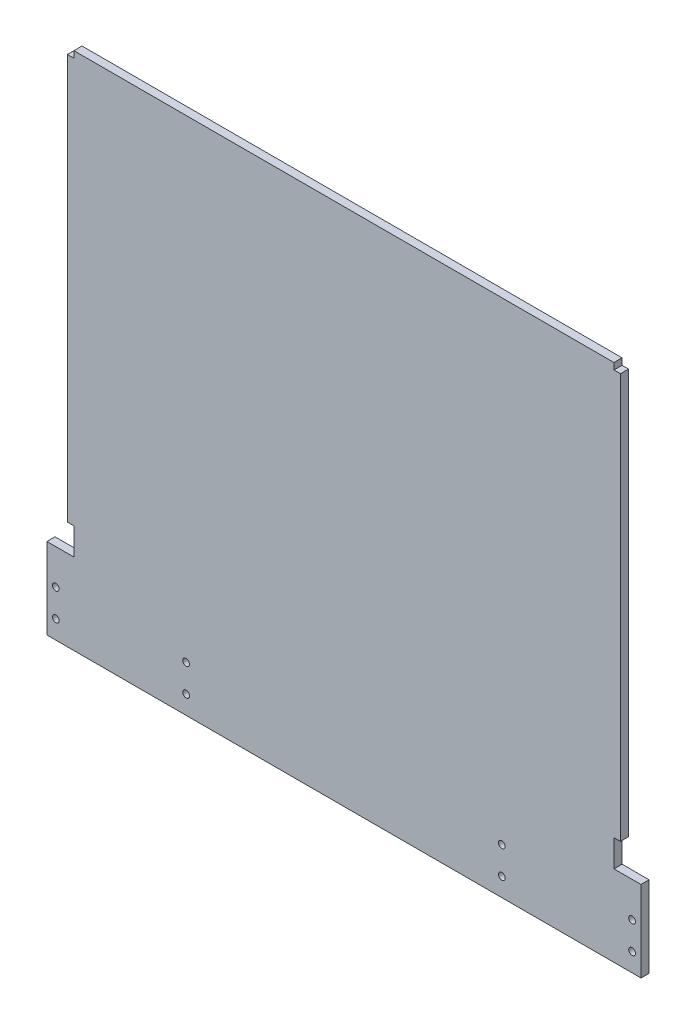
ISO-10303-21;
HEADER;
FILE_DESCRIPTION(('STEP AP214'),'2;1');
FILE_NAME('part.step','',(''),(''),'','','');
FILE_SCHEMA(('AUTOMOTIVE_DESIGN { 1 0 10303 214 1 1 1 1 }'));
ENDSEC;
DATA;
#1=APPLICATION_CONTEXT('core data for automotive mechanical design processes');
#2=APPLICATION_PROTOCOL_DEFINITION('international standard','automotive_design',2000,#1);
#3=PRODUCT_CONTEXT('',#1,'mechanical');
#4=PRODUCT('Part','Part','',(#3));
#5=PRODUCT_RELATED_PRODUCT_CATEGORY('part','',(#4));
#6=PRODUCT_DEFINITION_FORMATION('','',#4);
#7=PRODUCT_DEFINITION_CONTEXT('part definition',#1,'design');
#8=PRODUCT_DEFINITION('design','',#6,#7);
#9=PRODUCT_DEFINITION_SHAPE('','',#8);
#10=(LENGTH_UNIT() NAMED_UNIT(*) SI_UNIT(.MILLI.,.METRE.));
#11=(NAMED_UNIT(*) PLANE_ANGLE_UNIT() SI_UNIT($,.RADIAN.));
#12=(NAMED_UNIT(*) SI_UNIT($,.STERADIAN.) SOLID_ANGLE_UNIT());
#13=UNCERTAINTY_MEASURE_WITH_UNIT(LENGTH_MEASURE(1.E-05),#10,'distance_accuracy_value','');
#14=(GEOMETRIC_REPRESENTATION_CONTEXT(3) GLOBAL_UNCERTAINTY_ASSIGNED_CONTEXT((#13)) GLOBAL_UNIT_ASSIGNED_CONTEXT((#10,
#11,#12)) REPRESENTATION_CONTEXT('',''));
#15=CARTESIAN_POINT('',(0.,0.,0.));
#16=DIRECTION('',(0.,0.,1.));
#17=DIRECTION('',(1.,0.,0.));
#18=AXIS2_PLACEMENT_3D('',#15,#16,#17);
#19=CARTESIAN_POINT('',(-46.3904694643583,141.366907675195,3.));
#20=DIRECTION('',(0.,-1.,0.));
#21=DIRECTION('',(0.,0.,-1.));
#22=AXIS2_PLACEMENT_3D('',#19,#20,#21);
#23=PLANE('',#22);
#24=DIRECTION('',(-1.,0.,0.));
#25=VECTOR('',#24,1.);
#26=CARTESIAN_POINT('',(-46.3904694643583,141.366907675195,0.));
#27=LINE('',#26,#25);
#28=CARTESIAN_POINT('',(153.609530535642,141.366907675195,0.));
#29=VERTEX_POINT('',#28);
#30=CARTESIAN_POINT('',(-46.3904694643583,141.366907675195,0.));
#31=VERTEX_POINT('',#30);
#32=EDGE_CURVE('E178',#29,#31,#27,.T.);
#33=ORIENTED_EDGE('',*,*,#32,.T.);
#34=DIRECTION('',(0.,0.,-1.));
#35=VECTOR('',#34,1.);
#36=CARTESIAN_POINT('',(-46.3904694643583,141.366907675195,3.));
#37=LINE('',#36,#35);
#38=CARTESIAN_POINT('',(-46.3904694643583,141.366907675195,3.));
#39=VERTEX_POINT('',#38);
#40=EDGE_CURVE('E11',#39,#31,#37,.T.);
#41=ORIENTED_EDGE('',*,*,#40,.F.);
#42=DIRECTION('',(-1.,0.,0.));
#43=VECTOR('',#42,1.);
#44=CARTESIAN_POINT('',(-46.3904694643583,141.366907675195,3.));
#45=LINE('',#44,#43);
#46=CARTESIAN_POINT('',(153.609530535642,141.366907675195,3.));
#47=VERTEX_POINT('',#46);
#48=EDGE_CURVE('E209',#47,#39,#45,.T.);
#49=ORIENTED_EDGE('',*,*,#48,.F.);
#50=DIRECTION('',(0.,0.,-1.));
#51=VECTOR('',#50,1.);
#52=CARTESIAN_POINT('',(153.609530535642,141.366907675195,3.));
#53=LINE('',#52,#51);
#54=EDGE_CURVE('E174',#47,#29,#53,.T.);
#55=ORIENTED_EDGE('',*,*,#54,.T.);
#56=EDGE_LOOP('',(#33,#41,#49,#55));
#57=FACE_BOUND('',#56,.T.);
#58=ADVANCED_FACE('F32',(#57),#23,.F.);
#59=CARTESIAN_POINT('',(-46.3904694643583,141.366907675195,3.));
#60=DIRECTION('',(1.,0.,0.));
#61=DIRECTION('',(0.,0.,-1.));
#62=AXIS2_PLACEMENT_3D('',#59,#60,#61);
#63=PLANE('',#62);
#64=DIRECTION('',(0.,-1.,0.));
#65=VECTOR('',#64,1.);
#66=CARTESIAN_POINT('',(-46.3904694643583,141.366907675195,0.));
#67=LINE('',#66,#65);
#68=CARTESIAN_POINT('',(-46.3904694643583,138.966907675195,0.));
#69=VERTEX_POINT('',#68);
#70=EDGE_CURVE('E181',#31,#69,#67,.T.);
#71=ORIENTED_EDGE('',*,*,#70,.T.);
#72=DIRECTION('',(0.,0.,-1.));
#73=VECTOR('',#72,1.);
#74=CARTESIAN_POINT('',(-46.3904694643583,138.966907675195,3.));
#75=LINE('',#74,#73);
#76=CARTESIAN_POINT('',(-46.3904694643583,138.966907675195,3.));
#77=VERTEX_POINT('',#76);
#78=EDGE_CURVE('E41',#77,#69,#75,.T.);
#79=ORIENTED_EDGE('',*,*,#78,.F.);
#80=DIRECTION('',(0.,-1.,0.));
#81=VECTOR('',#80,1.);
#82=CARTESIAN_POINT('',(-46.3904694643583,141.366907675195,3.));
#83=LINE('',#82,#81);
#84=EDGE_CURVE('E117',#39,#77,#83,.T.);
#85=ORIENTED_EDGE('',*,*,#84,.F.);
#86=ORIENTED_EDGE('',*,*,#40,.T.);
#87=EDGE_LOOP('',(#71,#79,#85,#86));
#88=FACE_BOUND('',#87,.T.);
#89=ADVANCED_FACE('F342',(#88),#63,.F.);
#90=CARTESIAN_POINT('',(-46.3904694643583,138.966907675195,3.));
#91=DIRECTION('',(0.,-1.,0.));
#92=DIRECTION('',(0.,0.,-1.));
#93=AXIS2_PLACEMENT_3D('',#90,#91,#92);
#94=PLANE('',#93);
#95=DIRECTION('',(-1.,0.,0.));
#96=VECTOR('',#95,1.);
#97=CARTESIAN_POINT('',(-46.3904694643583,138.966907675195,0.));
#98=LINE('',#97,#96);
#99=CARTESIAN_POINT('',(-48.7904694643583,138.966907675195,0.));
#100=VERTEX_POINT('',#99);
#101=EDGE_CURVE('E184',#69,#100,#98,.T.);
#102=ORIENTED_EDGE('',*,*,#101,.T.);
#103=DIRECTION('',(0.,0.,-1.));
#104=VECTOR('',#103,1.);
#105=CARTESIAN_POINT('',(-48.7904694643583,138.966907675195,3.));
#106=LINE('',#105,#104);
#107=CARTESIAN_POINT('',(-48.7904694643583,138.966907675195,3.));
#108=VERTEX_POINT('',#107);
#109=EDGE_CURVE('E240',#108,#100,#106,.T.);
#110=ORIENTED_EDGE('',*,*,#109,.F.);
#111=DIRECTION('',(-1.,0.,0.));
#112=VECTOR('',#111,1.);
#113=CARTESIAN_POINT('',(-46.3904694643583,138.966907675195,3.));
#114=LINE('',#113,#112);
#115=EDGE_CURVE('E294',#77,#108,#114,.T.);
#116=ORIENTED_EDGE('',*,*,#115,.F.);
#117=ORIENTED_EDGE('',*,*,#78,.T.);
#118=EDGE_LOOP('',(#102,#110,#116,#117));
#119=FACE_BOUND('',#118,.T.);
#120=ADVANCED_FACE('F346',(#119),#94,.F.);
#121=CARTESIAN_POINT('',(-48.7904694643583,138.966907675195,3.));
#122=DIRECTION('',(1.,0.,0.));
#123=DIRECTION('',(0.,1.,0.));
#124=AXIS2_PLACEMENT_3D('',#121,#122,#123);
#125=PLANE('',#124);
#126=DIRECTION('',(0.,-1.,0.));
#127=VECTOR('',#126,1.);
#128=CARTESIAN_POINT('',(-48.7904694643583,138.966907675195,0.));
#129=LINE('',#128,#127);
#130=CARTESIAN_POINT('',(-48.7904694643584,-11.0330923248055,0.));
#131=VERTEX_POINT('',#130);
#132=EDGE_CURVE('E186',#100,#131,#129,.T.);
#133=ORIENTED_EDGE('',*,*,#132,.T.);
#134=DIRECTION('',(0.,0.,-1.));
#135=VECTOR('',#134,1.);
#136=CARTESIAN_POINT('',(-48.7904694643584,-11.0330923248055,3.));
#137=LINE('',#136,#135);
#138=CARTESIAN_POINT('',(-48.7904694643584,-11.0330923248055,3.));
#139=VERTEX_POINT('',#138);
#140=EDGE_CURVE('E237',#139,#131,#137,.T.);
#141=ORIENTED_EDGE('',*,*,#140,.F.);
#142=DIRECTION('',(0.,-1.,0.));
#143=VECTOR('',#142,1.);
#144=CARTESIAN_POINT('',(-48.7904694643583,138.966907675195,3.));
#145=LINE('',#144,#143);
#146=EDGE_CURVE('E296',#108,#139,#145,.T.);
#147=ORIENTED_EDGE('',*,*,#146,.F.);
#148=ORIENTED_EDGE('',*,*,#109,.T.);
#149=EDGE_LOOP('',(#133,#141,#147,#148));
#150=FACE_BOUND('',#149,.T.);
#151=ADVANCED_FACE('F350',(#150),#125,.F.);
#152=CARTESIAN_POINT('',(-48.7904694643584,-11.0330923248055,3.));
#153=DIRECTION('',(0.,1.,0.));
#154=DIRECTION('',(0.,0.,1.));
#155=AXIS2_PLACEMENT_3D('',#152,#153,#154);
#156=PLANE('',#155);
#157=DIRECTION('',(1.,0.,0.));
#158=VECTOR('',#157,1.);
#159=CARTESIAN_POINT('',(-48.7904694643584,-11.0330923248055,0.));
#160=LINE('',#159,#158);
#161=CARTESIAN_POINT('',(-46.3904694643583,-11.0330923248055,0.));
#162=VERTEX_POINT('',#161);
#163=EDGE_CURVE('E188',#131,#162,#160,.T.);
#164=ORIENTED_EDGE('',*,*,#163,.T.);
#165=DIRECTION('',(0.,0.,-1.));
#166=VECTOR('',#165,1.);
#167=CARTESIAN_POINT('',(-46.3904694643583,-11.0330923248055,3.));
#168=LINE('',#167,#166);
#169=CARTESIAN_POINT('',(-46.3904694643583,-11.0330923248055,3.));
#170=VERTEX_POINT('',#169);
#171=EDGE_CURVE('E234',#170,#162,#168,.T.);
#172=ORIENTED_EDGE('',*,*,#171,.F.);
#173=DIRECTION('',(1.,0.,0.));
#174=VECTOR('',#173,1.);
#175=CARTESIAN_POINT('',(-48.7904694643584,-11.0330923248055,3.));
#176=LINE('',#175,#174);
#177=EDGE_CURVE('E298',#139,#170,#176,.T.);
#178=ORIENTED_EDGE('',*,*,#177,.F.);
#179=ORIENTED_EDGE('',*,*,#140,.T.);
#180=EDGE_LOOP('',(#164,#172,#178,#179));
#181=FACE_BOUND('',#180,.T.);
#182=ADVANCED_FACE('F356',(#181),#156,.F.);
#183=CARTESIAN_POINT('',(-46.3904694643583,-11.0330923248055,3.));
#184=DIRECTION('',(1.,0.,0.));
#185=DIRECTION('',(0.,0.,-1.));
#186=AXIS2_PLACEMENT_3D('',#183,#184,#185);
#187=PLANE('',#186);
#188=DIRECTION('',(0.,-1.,0.));
#189=VECTOR('',#188,1.);
#190=CARTESIAN_POINT('',(-46.3904694643583,-11.0330923248055,0.));
#191=LINE('',#190,#189);
#192=CARTESIAN_POINT('',(-46.3904694643583,-21.0330923248055,0.));
#193=VERTEX_POINT('',#192);
#194=EDGE_CURVE('E190',#162,#193,#191,.T.);
#195=ORIENTED_EDGE('',*,*,#194,.T.);
#196=DIRECTION('',(0.,0.,-1.));
#197=VECTOR('',#196,1.);
#198=CARTESIAN_POINT('',(-46.3904694643583,-21.0330923248055,3.));
#199=LINE('',#198,#197);
#200=CARTESIAN_POINT('',(-46.3904694643583,-21.0330923248055,3.));
#201=VERTEX_POINT('',#200);
#202=EDGE_CURVE('E231',#201,#193,#199,.T.);
#203=ORIENTED_EDGE('',*,*,#202,.F.);
#204=DIRECTION('',(0.,-1.,0.));
#205=VECTOR('',#204,1.);
#206=CARTESIAN_POINT('',(-46.3904694643583,-11.0330923248055,3.));
#207=LINE('',#206,#205);
#208=EDGE_CURVE('E300',#170,#201,#207,.T.);
#209=ORIENTED_EDGE('',*,*,#208,.F.);
#210=ORIENTED_EDGE('',*,*,#171,.T.);
#211=EDGE_LOOP('',(#195,#203,#209,#210));
#212=FACE_BOUND('',#211,.T.);
#213=ADVANCED_FACE('F360',(#212),#187,.F.);
#214=CARTESIAN_POINT('',(-46.3904694643583,-21.0330923248055,3.));
#215=DIRECTION('',(0.,-1.,0.));
#216=DIRECTION('',(0.,0.,-1.));
#217=AXIS2_PLACEMENT_3D('',#214,#215,#216);
#218=PLANE('',#217);
#219=DIRECTION('',(-1.,0.,0.));
#220=VECTOR('',#219,1.);
#221=CARTESIAN_POINT('',(-46.3904694643583,-21.0330923248055,0.));
#222=LINE('',#221,#220);
#223=CARTESIAN_POINT('',(-56.3904694643583,-21.0330923248055,0.));
#224=VERTEX_POINT('',#223);
#225=EDGE_CURVE('E192',#193,#224,#222,.T.);
#226=ORIENTED_EDGE('',*,*,#225,.T.);
#227=DIRECTION('',(0.,0.,-1.));
#228=VECTOR('',#227,1.);
#229=CARTESIAN_POINT('',(-56.3904694643583,-21.0330923248055,3.));
#230=LINE('',#229,#228);
#231=CARTESIAN_POINT('',(-56.3904694643583,-21.0330923248055,3.));
#232=VERTEX_POINT('',#231);
#233=EDGE_CURVE('E228',#232,#224,#230,.T.);
#234=ORIENTED_EDGE('',*,*,#233,.F.);
#235=DIRECTION('',(-1.,0.,0.));
#236=VECTOR('',#235,1.);
#237=CARTESIAN_POINT('',(-46.3904694643583,-21.0330923248055,3.));
#238=LINE('',#237,#236);
#239=EDGE_CURVE('E302',#201,#232,#238,.T.);
#240=ORIENTED_EDGE('',*,*,#239,.F.);
#241=ORIENTED_EDGE('',*,*,#202,.T.);
#242=EDGE_LOOP('',(#226,#234,#240,#241));
#243=FACE_BOUND('',#242,.T.);
#244=ADVANCED_FACE('F364',(#243),#218,.F.);
#245=CARTESIAN_POINT('',(-56.3904694643583,-21.0330923248055,3.));
#246=DIRECTION('',(1.,0.,0.));
#247=DIRECTION('',(0.,0.,-1.));
#248=AXIS2_PLACEMENT_3D('',#245,#246,#247);
#249=PLANE('',#248);
#250=DIRECTION('',(0.,-1.,0.));
#251=VECTOR('',#250,1.);
#252=CARTESIAN_POINT('',(-56.3904694643583,-21.0330923248055,0.));
#253=LINE('',#252,#251);
#254=CARTESIAN_POINT('',(-56.3904694643583,-51.0330923248055,0.));
#255=VERTEX_POINT('',#254);
#256=EDGE_CURVE('E194',#224,#255,#253,.T.);
#257=ORIENTED_EDGE('',*,*,#256,.T.);
#258=DIRECTION('',(0.,0.,-1.));
#259=VECTOR('',#258,1.);
#260=CARTESIAN_POINT('',(-56.3904694643583,-51.0330923248055,3.));
#261=LINE('',#260,#259);
#262=CARTESIAN_POINT('',(-56.3904694643583,-51.0330923248055,3.));
#263=VERTEX_POINT('',#262);
#264=EDGE_CURVE('E225',#263,#255,#261,.T.);
#265=ORIENTED_EDGE('',*,*,#264,.F.);
#266=DIRECTION('',(0.,-1.,0.));
#267=VECTOR('',#266,1.);
#268=CARTESIAN_POINT('',(-56.3904694643583,-21.0330923248055,3.));
#269=LINE('',#268,#267);
#270=EDGE_CURVE('E304',#232,#263,#269,.T.);
#271=ORIENTED_EDGE('',*,*,#270,.F.);
#272=ORIENTED_EDGE('',*,*,#233,.T.);
#273=EDGE_LOOP('',(#257,#265,#271,#272));
#274=FACE_BOUND('',#273,.T.);
#275=ADVANCED_FACE('F368',(#274),#249,.F.);
#276=CARTESIAN_POINT('',(163.609530535642,-51.0330923248055,3.));
#277=DIRECTION('',(0.,1.,0.));
#278=DIRECTION('',(0.,0.,1.));
#279=AXIS2_PLACEMENT_3D('',#276,#277,#278);
#280=PLANE('',#279);
#281=DIRECTION('',(1.,0.,0.));
#282=VECTOR('',#281,1.);
#283=CARTESIAN_POINT('',(163.609530535642,-51.0330923248055,0.));
#284=LINE('',#283,#282);
#285=CARTESIAN_POINT('',(163.609530535642,-51.0330923248055,0.));
#286=VERTEX_POINT('',#285);
#287=EDGE_CURVE('E196',#255,#286,#284,.T.);
#288=ORIENTED_EDGE('',*,*,#287,.T.);
#289=DIRECTION('',(0.,0.,-1.));
#290=VECTOR('',#289,1.);
#291=CARTESIAN_POINT('',(163.609530535642,-51.0330923248055,3.));
#292=LINE('',#291,#290);
#293=CARTESIAN_POINT('',(163.609530535642,-51.0330923248055,3.));
#294=VERTEX_POINT('',#293);
#295=EDGE_CURVE('E222',#294,#286,#292,.T.);
#296=ORIENTED_EDGE('',*,*,#295,.F.);
#297=DIRECTION('',(1.,0.,0.));
#298=VECTOR('',#297,1.);
#299=CARTESIAN_POINT('',(163.609530535642,-51.0330923248055,3.));
#300=LINE('',#299,#298);
#301=EDGE_CURVE('E306',#263,#294,#300,.T.);
#302=ORIENTED_EDGE('',*,*,#301,.F.);
#303=ORIENTED_EDGE('',*,*,#264,.T.);
#304=EDGE_LOOP('',(#288,#296,#302,#303));
#305=FACE_BOUND('',#304,.T.);
#306=ADVANCED_FACE('F372',(#305),#280,.F.);
#307=CARTESIAN_POINT('',(163.609530535642,-21.0330923248055,3.));
#308=DIRECTION('',(-1.,0.,0.));
#309=DIRECTION('',(0.,0.,1.));
#310=AXIS2_PLACEMENT_3D('',#307,#308,#309);
#311=PLANE('',#310);
#312=DIRECTION('',(0.,1.,0.));
#313=VECTOR('',#312,1.);
#314=CARTESIAN_POINT('',(163.609530535642,-21.0330923248055,0.));
#315=LINE('',#314,#313);
#316=CARTESIAN_POINT('',(163.609530535642,-21.0330923248055,0.));
#317=VERTEX_POINT('',#316);
#318=EDGE_CURVE('E198',#286,#317,#315,.T.);
#319=ORIENTED_EDGE('',*,*,#318,.T.);
#320=DIRECTION('',(0.,0.,-1.));
#321=VECTOR('',#320,1.);
#322=CARTESIAN_POINT('',(163.609530535642,-21.0330923248055,3.));
#323=LINE('',#322,#321);
#324=CARTESIAN_POINT('',(163.609530535642,-21.0330923248055,3.));
#325=VERTEX_POINT('',#324);
#326=EDGE_CURVE('E219',#325,#317,#323,.T.);
#327=ORIENTED_EDGE('',*,*,#326,.F.);
#328=DIRECTION('',(0.,1.,0.));
#329=VECTOR('',#328,1.);
#330=CARTESIAN_POINT('',(163.609530535642,-21.0330923248055,3.));
#331=LINE('',#330,#329);
#332=EDGE_CURVE('E308',#294,#325,#331,.T.);
#333=ORIENTED_EDGE('',*,*,#332,.F.);
#334=ORIENTED_EDGE('',*,*,#295,.T.);
#335=EDGE_LOOP('',(#319,#327,#333,#334));
#336=FACE_BOUND('',#335,.T.);
#337=ADVANCED_FACE('F376',(#336),#311,.F.);
#338=CARTESIAN_POINT('',(153.609530535642,-21.0330923248055,3.));
#339=DIRECTION('',(0.,-1.,0.));
#340=DIRECTION('',(0.,0.,-1.));
#341=AXIS2_PLACEMENT_3D('',#338,#339,#340);
#342=PLANE('',#341);
#343=DIRECTION('',(-1.,0.,0.));
#344=VECTOR('',#343,1.);
#345=CARTESIAN_POINT('',(153.609530535642,-21.0330923248055,0.));
#346=LINE('',#345,#344);
#347=CARTESIAN_POINT('',(153.609530535642,-21.0330923248055,0.));
#348=VERTEX_POINT('',#347);
#349=EDGE_CURVE('E200',#317,#348,#346,.T.);
#350=ORIENTED_EDGE('',*,*,#349,.T.);
#351=DIRECTION('',(0.,0.,-1.));
#352=VECTOR('',#351,1.);
#353=CARTESIAN_POINT('',(153.609530535642,-21.0330923248055,3.));
#354=LINE('',#353,#352);
#355=CARTESIAN_POINT('',(153.609530535642,-21.0330923248055,3.));
#356=VERTEX_POINT('',#355);
#357=EDGE_CURVE('E216',#356,#348,#354,.T.);
#358=ORIENTED_EDGE('',*,*,#357,.F.);
#359=DIRECTION('',(-1.,0.,0.));
#360=VECTOR('',#359,1.);
#361=CARTESIAN_POINT('',(153.609530535642,-21.0330923248055,3.));
#362=LINE('',#361,#360);
#363=EDGE_CURVE('E310',#325,#356,#362,.T.);
#364=ORIENTED_EDGE('',*,*,#363,.F.);
#365=ORIENTED_EDGE('',*,*,#326,.T.);
#366=EDGE_LOOP('',(#350,#358,#364,#365));
#367=FACE_BOUND('',#366,.T.);
#368=ADVANCED_FACE('F380',(#367),#342,.F.);
#369=CARTESIAN_POINT('',(153.609530535642,-11.0330923248055,3.));
#370=DIRECTION('',(-1.,0.,0.));
#371=DIRECTION('',(0.,0.,1.));
#372=AXIS2_PLACEMENT_3D('',#369,#370,#371);
#373=PLANE('',#372);
#374=DIRECTION('',(0.,1.,0.));
#375=VECTOR('',#374,1.);
#376=CARTESIAN_POINT('',(153.609530535642,-11.0330923248055,0.));
#377=LINE('',#376,#375);
#378=CARTESIAN_POINT('',(153.609530535642,-11.0330923248055,0.));
#379=VERTEX_POINT('',#378);
#380=EDGE_CURVE('E202',#348,#379,#377,.T.);
#381=ORIENTED_EDGE('',*,*,#380,.T.);
#382=DIRECTION('',(0.,0.,-1.));
#383=VECTOR('',#382,1.);
#384=CARTESIAN_POINT('',(153.609530535642,-11.0330923248055,3.));
#385=LINE('',#384,#383);
#386=CARTESIAN_POINT('',(153.609530535642,-11.0330923248055,3.));
#387=VERTEX_POINT('',#386);
#388=EDGE_CURVE('E213',#387,#379,#385,.T.);
#389=ORIENTED_EDGE('',*,*,#388,.F.);
#390=DIRECTION('',(0.,1.,0.));
#391=VECTOR('',#390,1.);
#392=CARTESIAN_POINT('',(153.609530535642,-11.0330923248055,3.));
#393=LINE('',#392,#391);
#394=EDGE_CURVE('E312',#356,#387,#393,.T.);
#395=ORIENTED_EDGE('',*,*,#394,.F.);
#396=ORIENTED_EDGE('',*,*,#357,.T.);
#397=EDGE_LOOP('',(#381,#389,#395,#396));
#398=FACE_BOUND('',#397,.T.);
#399=ADVANCED_FACE('F318',(#398),#373,.F.);
#400=CARTESIAN_POINT('',(156.009530535642,-11.0330923248055,3.));
#401=DIRECTION('',(0.,1.,0.));
#402=DIRECTION('',(0.,0.,1.));
#403=AXIS2_PLACEMENT_3D('',#400,#401,#402);
#404=PLANE('',#403);
#405=DIRECTION('',(1.,0.,0.));
#406=VECTOR('',#405,1.);
#407=CARTESIAN_POINT('',(156.009530535642,-11.0330923248055,0.));
#408=LINE('',#407,#406);
#409=CARTESIAN_POINT('',(156.009530535642,-11.0330923248055,0.));
#410=VERTEX_POINT('',#409);
#411=EDGE_CURVE('E204',#379,#410,#408,.T.);
#412=ORIENTED_EDGE('',*,*,#411,.T.);
#413=DIRECTION('',(0.,0.,-1.));
#414=VECTOR('',#413,1.);
#415=CARTESIAN_POINT('',(156.009530535642,-11.0330923248055,3.));
#416=LINE('',#415,#414);
#417=CARTESIAN_POINT('',(156.009530535642,-11.0330923248055,3.));
#418=VERTEX_POINT('',#417);
#419=EDGE_CURVE('E169',#418,#410,#416,.T.);
#420=ORIENTED_EDGE('',*,*,#419,.F.);
#421=DIRECTION('',(1.,0.,0.));
#422=VECTOR('',#421,1.);
#423=CARTESIAN_POINT('',(156.009530535642,-11.0330923248055,3.));
#424=LINE('',#423,#422);
#425=EDGE_CURVE('E160',#387,#418,#424,.T.);
#426=ORIENTED_EDGE('',*,*,#425,.F.);
#427=ORIENTED_EDGE('',*,*,#388,.T.);
#428=EDGE_LOOP('',(#412,#420,#426,#427));
#429=FACE_BOUND('',#428,.T.);
#430=ADVANCED_FACE('F322',(#429),#404,.F.);
#431=CARTESIAN_POINT('',(156.009530535642,138.966907675195,3.));
#432=DIRECTION('',(-1.,0.,0.));
#433=DIRECTION('',(0.,-1.,0.));
#434=AXIS2_PLACEMENT_3D('',#431,#432,#433);
#435=PLANE('',#434);
#436=DIRECTION('',(0.,1.,0.));
#437=VECTOR('',#436,1.);
#438=CARTESIAN_POINT('',(156.009530535642,138.966907675195,0.));
#439=LINE('',#438,#437);
#440=CARTESIAN_POINT('',(156.009530535642,138.966907675195,0.));
#441=VERTEX_POINT('',#440);
#442=EDGE_CURVE('E168',#410,#441,#439,.T.);
#443=ORIENTED_EDGE('',*,*,#442,.T.);
#444=DIRECTION('',(0.,0.,-1.));
#445=VECTOR('',#444,1.);
#446=CARTESIAN_POINT('',(156.009530535642,138.966907675195,3.));
#447=LINE('',#446,#445);
#448=CARTESIAN_POINT('',(156.009530535642,138.966907675195,3.));
#449=VERTEX_POINT('',#448);
#450=EDGE_CURVE('E165',#449,#441,#447,.T.);
#451=ORIENTED_EDGE('',*,*,#450,.F.);
#452=DIRECTION('',(0.,1.,0.));
#453=VECTOR('',#452,1.);
#454=CARTESIAN_POINT('',(156.009530535642,138.966907675195,3.));
#455=LINE('',#454,#453);
#456=EDGE_CURVE('E154',#418,#449,#455,.T.);
#457=ORIENTED_EDGE('',*,*,#456,.F.);
#458=ORIENTED_EDGE('',*,*,#419,.T.);
#459=EDGE_LOOP('',(#443,#451,#457,#458));
#460=FACE_BOUND('',#459,.T.);
#461=ADVANCED_FACE('F166',(#460),#435,.F.);
#462=CARTESIAN_POINT('',(153.609530535642,138.966907675195,3.));
#463=DIRECTION('',(0.,-1.,0.));
#464=DIRECTION('',(0.,0.,-1.));
#465=AXIS2_PLACEMENT_3D('',#462,#463,#464);
#466=PLANE('',#465);
#467=DIRECTION('',(-1.,0.,0.));
#468=VECTOR('',#467,1.);
#469=CARTESIAN_POINT('',(153.609530535642,138.966907675195,0.));
#470=LINE('',#469,#468);
#471=CARTESIAN_POINT('',(153.609530535642,138.966907675195,0.));
#472=VERTEX_POINT('',#471);
#473=EDGE_CURVE('E103',#441,#472,#470,.T.);
#474=ORIENTED_EDGE('',*,*,#473,.T.);
#475=DIRECTION('',(0.,0.,-1.));
#476=VECTOR('',#475,1.);
#477=CARTESIAN_POINT('',(153.609530535642,138.966907675195,3.));
#478=LINE('',#477,#476);
#479=CARTESIAN_POINT('',(153.609530535642,138.966907675195,3.));
#480=VERTEX_POINT('',#479);
#481=EDGE_CURVE('E170',#480,#472,#478,.T.);
#482=ORIENTED_EDGE('',*,*,#481,.F.);
#483=DIRECTION('',(-1.,0.,0.));
#484=VECTOR('',#483,1.);
#485=CARTESIAN_POINT('',(153.609530535642,138.966907675195,3.));
#486=LINE('',#485,#484);
#487=EDGE_CURVE('E158',#449,#480,#486,.T.);
#488=ORIENTED_EDGE('',*,*,#487,.F.);
#489=ORIENTED_EDGE('',*,*,#450,.T.);
#490=EDGE_LOOP('',(#474,#482,#488,#489));
#491=FACE_BOUND('',#490,.T.);
#492=ADVANCED_FACE('F172',(#491),#466,.F.);
#493=CARTESIAN_POINT('',(153.609530535642,141.366907675195,3.));
#494=DIRECTION('',(-1.,0.,0.));
#495=DIRECTION('',(0.,0.,1.));
#496=AXIS2_PLACEMENT_3D('',#493,#494,#495);
#497=PLANE('',#496);
#498=DIRECTION('',(0.,1.,0.));
#499=VECTOR('',#498,1.);
#500=CARTESIAN_POINT('',(153.609530535642,141.366907675195,0.));
#501=LINE('',#500,#499);
#502=EDGE_CURVE('E109',#472,#29,#501,.T.);
#503=ORIENTED_EDGE('',*,*,#502,.T.);
#504=ORIENTED_EDGE('',*,*,#54,.F.);
#505=DIRECTION('',(0.,1.,0.));
#506=VECTOR('',#505,1.);
#507=CARTESIAN_POINT('',(153.609530535642,141.366907675195,3.));
#508=LINE('',#507,#506);
#509=EDGE_CURVE('E50',#480,#47,#508,.T.);
#510=ORIENTED_EDGE('',*,*,#509,.F.);
#511=ORIENTED_EDGE('',*,*,#481,.T.);
#512=EDGE_LOOP('',(#503,#504,#510,#511));
#513=FACE_BOUND('',#512,.T.);
#514=ADVANCED_FACE('F330',(#513),#497,.F.);
#515=CARTESIAN_POINT('',(153.609530535642,141.366907675195,3.));
#516=DIRECTION('',(0.,0.,-1.));
#517=DIRECTION('',(-1.,0.,0.));
#518=AXIS2_PLACEMENT_3D('',#515,#516,#517);
#519=PLANE('',#518);
#520=CARTESIAN_POINT('',(-53.1004694643583,-34.0330923248054,3.));
#521=DIRECTION('',(0.,0.,1.));
#522=DIRECTION('',(-1.,0.,0.));
#523=AXIS2_PLACEMENT_3D('',#520,#521,#522);
#524=CIRCLE('',#523,1.25000000000001);
#525=CARTESIAN_POINT('',(-54.3504694643583,-34.0330923248054,3.));
#526=VERTEX_POINT('',#525);
#527=EDGE_CURVE('E279',#526,#526,#524,.T.);
#528=ORIENTED_EDGE('',*,*,#527,.F.);
#529=EDGE_LOOP('',(#528));
#530=FACE_BOUND('',#529,.T.);
#531=CARTESIAN_POINT('',(-4.84046946435834,-34.0330923248053,3.));
#532=DIRECTION('',(0.,0.,1.));
#533=DIRECTION('',(-1.,0.,0.));
#534=AXIS2_PLACEMENT_3D('',#531,#532,#533);
#535=CIRCLE('',#534,1.24999999999991);
#536=CARTESIAN_POINT('',(-6.09046946435825,-34.0330923248053,3.));
#537=VERTEX_POINT('',#536);
#538=EDGE_CURVE('E269',#537,#537,#535,.T.);
#539=ORIENTED_EDGE('',*,*,#538,.F.);
#540=EDGE_LOOP('',(#539));
#541=FACE_BOUND('',#540,.T.);
#542=CARTESIAN_POINT('',(-53.1004694643583,-44.1930923248054,3.));
#543=DIRECTION('',(0.,0.,1.));
#544=DIRECTION('',(-1.,0.,0.));
#545=AXIS2_PLACEMENT_3D('',#542,#543,#544);
#546=CIRCLE('',#545,1.25000000000012);
#547=CARTESIAN_POINT('',(-54.3504694643585,-44.1930923248054,3.));
#548=VERTEX_POINT('',#547);
#549=EDGE_CURVE('E266',#548,#548,#546,.T.);
#550=ORIENTED_EDGE('',*,*,#549,.F.);
#551=EDGE_LOOP('',(#550));
#552=FACE_BOUND('',#551,.T.);
#553=CARTESIAN_POINT('',(-4.84046946435845,-44.1930923248057,3.));
#554=DIRECTION('',(0.,0.,1.));
#555=DIRECTION('',(-1.,0.,0.));
#556=AXIS2_PLACEMENT_3D('',#553,#554,#555);
#557=CIRCLE('',#556,1.25000000000001);
#558=CARTESIAN_POINT('',(-6.09046946435847,-44.1930923248057,3.));
#559=VERTEX_POINT('',#558);
#560=EDGE_CURVE('E263',#559,#559,#557,.T.);
#561=ORIENTED_EDGE('',*,*,#560,.F.);
#562=EDGE_LOOP('',(#561));
#563=FACE_BOUND('',#562,.T.);
#564=CARTESIAN_POINT('',(112.059530535642,-44.1930923248058,3.));
#565=DIRECTION('',(0.,0.,1.));
#566=DIRECTION('',(1.,0.,0.));
#567=AXIS2_PLACEMENT_3D('',#564,#565,#566);
#568=CIRCLE('',#567,1.25000000000001);
#569=CARTESIAN_POINT('',(113.309530535642,-44.1930923248058,3.));
#570=VERTEX_POINT('',#569);
#571=EDGE_CURVE('E259',#570,#570,#568,.T.);
#572=ORIENTED_EDGE('',*,*,#571,.F.);
#573=EDGE_LOOP('',(#572));
#574=FACE_BOUND('',#573,.T.);
#575=CARTESIAN_POINT('',(160.319530535642,-44.1930923248055,3.));
#576=DIRECTION('',(0.,0.,1.));
#577=DIRECTION('',(1.,0.,0.));
#578=AXIS2_PLACEMENT_3D('',#575,#576,#577);
#579=CIRCLE('',#578,1.25000000000012);
#580=CARTESIAN_POINT('',(161.569530535642,-44.1930923248055,3.));
#581=VERTEX_POINT('',#580);
#582=EDGE_CURVE('E255',#581,#581,#579,.T.);
#583=ORIENTED_EDGE('',*,*,#582,.F.);
#584=EDGE_LOOP('',(#583));
#585=FACE_BOUND('',#584,.T.);
#586=CARTESIAN_POINT('',(112.059530535642,-34.0330923248055,3.));
#587=DIRECTION('',(0.,0.,1.));
#588=DIRECTION('',(1.,0.,0.));
#589=AXIS2_PLACEMENT_3D('',#586,#587,#588);
#590=CIRCLE('',#589,1.24999999999991);
#591=CARTESIAN_POINT('',(113.309530535642,-34.0330923248055,3.));
#592=VERTEX_POINT('',#591);
#593=EDGE_CURVE('E251',#592,#592,#590,.T.);
#594=ORIENTED_EDGE('',*,*,#593,.F.);
#595=EDGE_LOOP('',(#594));
#596=FACE_BOUND('',#595,.T.);
#597=CARTESIAN_POINT('',(160.319530535642,-34.0330923248055,3.));
#598=DIRECTION('',(0.,0.,1.));
#599=DIRECTION('',(1.,0.,0.));
#600=AXIS2_PLACEMENT_3D('',#597,#598,#599);
#601=CIRCLE('',#600,1.25000000000001);
#602=CARTESIAN_POINT('',(161.569530535642,-34.0330923248055,3.));
#603=VERTEX_POINT('',#602);
#604=EDGE_CURVE('E247',#603,#603,#601,.T.);
#605=ORIENTED_EDGE('',*,*,#604,.F.);
#606=EDGE_LOOP('',(#605));
#607=FACE_BOUND('',#606,.T.);
#608=ORIENTED_EDGE('',*,*,#48,.T.);
#609=ORIENTED_EDGE('',*,*,#84,.T.);
#610=ORIENTED_EDGE('',*,*,#115,.T.);
#611=ORIENTED_EDGE('',*,*,#146,.T.);
#612=ORIENTED_EDGE('',*,*,#177,.T.);
#613=ORIENTED_EDGE('',*,*,#208,.T.);
#614=ORIENTED_EDGE('',*,*,#239,.T.);
#615=ORIENTED_EDGE('',*,*,#270,.T.);
#616=ORIENTED_EDGE('',*,*,#301,.T.);
#617=ORIENTED_EDGE('',*,*,#332,.T.);
#618=ORIENTED_EDGE('',*,*,#363,.T.);
#619=ORIENTED_EDGE('',*,*,#394,.T.);
#620=ORIENTED_EDGE('',*,*,#425,.T.);
#621=ORIENTED_EDGE('',*,*,#456,.T.);
#622=ORIENTED_EDGE('',*,*,#487,.T.);
#623=ORIENTED_EDGE('',*,*,#509,.T.);
#624=EDGE_LOOP('',(#608,#609,#610,#611,#612,#613,#614,#615,#616,#617,#618,#619,#620,#621,#622,#623));
#625=FACE_BOUND('',#624,.T.);
#626=ADVANCED_FACE('F156',(#530,#541,#552,#563,#574,#585,#596,#607,#625),#519,.F.);
#627=CARTESIAN_POINT('',(153.609530535642,141.366907675195,0.));
#628=DIRECTION('',(0.,0.,-1.));
#629=DIRECTION('',(-1.,0.,0.));
#630=AXIS2_PLACEMENT_3D('',#627,#628,#629);
#631=PLANE('',#630);
#632=CARTESIAN_POINT('',(-53.1004694643583,-34.0330923248054,0.));
#633=DIRECTION('',(0.,0.,-1.));
#634=DIRECTION('',(-1.,0.,0.));
#635=AXIS2_PLACEMENT_3D('',#632,#633,#634);
#636=CIRCLE('',#635,1.25000000000001);
#637=CARTESIAN_POINT('',(-54.3504694643583,-34.0330923248054,0.));
#638=VERTEX_POINT('',#637);
#639=EDGE_CURVE('E35',#638,#638,#636,.T.);
#640=ORIENTED_EDGE('',*,*,#639,.F.);
#641=EDGE_LOOP('',(#640));
#642=FACE_BOUND('',#641,.T.);
#643=CARTESIAN_POINT('',(-4.84046946435834,-34.0330923248053,0.));
#644=DIRECTION('',(0.,0.,-1.));
#645=DIRECTION('',(-1.,0.,0.));
#646=AXIS2_PLACEMENT_3D('',#643,#644,#645);
#647=CIRCLE('',#646,1.24999999999991);
#648=CARTESIAN_POINT('',(-6.09046946435825,-34.0330923248053,0.));
#649=VERTEX_POINT('',#648);
#650=EDGE_CURVE('E267',#649,#649,#647,.T.);
#651=ORIENTED_EDGE('',*,*,#650,.F.);
#652=EDGE_LOOP('',(#651));
#653=FACE_BOUND('',#652,.T.);
#654=CARTESIAN_POINT('',(-53.1004694643583,-44.1930923248054,0.));
#655=DIRECTION('',(0.,0.,-1.));
#656=DIRECTION('',(-1.,0.,0.));
#657=AXIS2_PLACEMENT_3D('',#654,#655,#656);
#658=CIRCLE('',#657,1.25000000000012);
#659=CARTESIAN_POINT('',(-54.3504694643585,-44.1930923248054,0.));
#660=VERTEX_POINT('',#659);
#661=EDGE_CURVE('E264',#660,#660,#658,.T.);
#662=ORIENTED_EDGE('',*,*,#661,.F.);
#663=EDGE_LOOP('',(#662));
#664=FACE_BOUND('',#663,.T.);
#665=CARTESIAN_POINT('',(-4.84046946435845,-44.1930923248057,0.));
#666=DIRECTION('',(0.,0.,-1.));
#667=DIRECTION('',(-1.,0.,0.));
#668=AXIS2_PLACEMENT_3D('',#665,#666,#667);
#669=CIRCLE('',#668,1.25000000000001);
#670=CARTESIAN_POINT('',(-6.09046946435847,-44.1930923248057,0.));
#671=VERTEX_POINT('',#670);
#672=EDGE_CURVE('E260',#671,#671,#669,.T.);
#673=ORIENTED_EDGE('',*,*,#672,.F.);
#674=EDGE_LOOP('',(#673));
#675=FACE_BOUND('',#674,.T.);
#676=CARTESIAN_POINT('',(112.059530535642,-44.1930923248058,0.));
#677=DIRECTION('',(0.,0.,-1.));
#678=DIRECTION('',(-1.,0.,0.));
#679=AXIS2_PLACEMENT_3D('',#676,#677,#678);
#680=CIRCLE('',#679,1.25000000000001);
#681=CARTESIAN_POINT('',(110.809530535642,-44.1930923248058,0.));
#682=VERTEX_POINT('',#681);
#683=EDGE_CURVE('E256',#682,#682,#680,.T.);
#684=ORIENTED_EDGE('',*,*,#683,.F.);
#685=EDGE_LOOP('',(#684));
#686=FACE_BOUND('',#685,.T.);
#687=CARTESIAN_POINT('',(160.319530535642,-44.1930923248055,0.));
#688=DIRECTION('',(0.,0.,-1.));
#689=DIRECTION('',(-1.,0.,0.));
#690=AXIS2_PLACEMENT_3D('',#687,#688,#689);
#691=CIRCLE('',#690,1.25000000000012);
#692=CARTESIAN_POINT('',(159.069530535642,-44.1930923248055,0.));
#693=VERTEX_POINT('',#692);
#694=EDGE_CURVE('E252',#693,#693,#691,.T.);
#695=ORIENTED_EDGE('',*,*,#694,.F.);
#696=EDGE_LOOP('',(#695));
#697=FACE_BOUND('',#696,.T.);
#698=CARTESIAN_POINT('',(112.059530535642,-34.0330923248055,0.));
#699=DIRECTION('',(0.,0.,-1.));
#700=DIRECTION('',(-1.,0.,0.));
#701=AXIS2_PLACEMENT_3D('',#698,#699,#700);
#702=CIRCLE('',#701,1.24999999999991);
#703=CARTESIAN_POINT('',(110.809530535642,-34.0330923248055,0.));
#704=VERTEX_POINT('',#703);
#705=EDGE_CURVE('E248',#704,#704,#702,.T.);
#706=ORIENTED_EDGE('',*,*,#705,.F.);
#707=EDGE_LOOP('',(#706));
#708=FACE_BOUND('',#707,.T.);
#709=CARTESIAN_POINT('',(160.319530535642,-34.0330923248055,0.));
#710=DIRECTION('',(0.,0.,-1.));
#711=DIRECTION('',(-1.,0.,0.));
#712=AXIS2_PLACEMENT_3D('',#709,#710,#711);
#713=CIRCLE('',#712,1.25000000000001);
#714=CARTESIAN_POINT('',(159.069530535642,-34.0330923248055,0.));
#715=VERTEX_POINT('',#714);
#716=EDGE_CURVE('E182',#715,#715,#713,.T.);
#717=ORIENTED_EDGE('',*,*,#716,.F.);
#718=EDGE_LOOP('',(#717));
#719=FACE_BOUND('',#718,.T.);
#720=ORIENTED_EDGE('',*,*,#32,.F.);
#721=ORIENTED_EDGE('',*,*,#502,.F.);
#722=ORIENTED_EDGE('',*,*,#473,.F.);
#723=ORIENTED_EDGE('',*,*,#442,.F.);
#724=ORIENTED_EDGE('',*,*,#411,.F.);
#725=ORIENTED_EDGE('',*,*,#380,.F.);
#726=ORIENTED_EDGE('',*,*,#349,.F.);
#727=ORIENTED_EDGE('',*,*,#318,.F.);
#728=ORIENTED_EDGE('',*,*,#287,.F.);
#729=ORIENTED_EDGE('',*,*,#256,.F.);
#730=ORIENTED_EDGE('',*,*,#225,.F.);
#731=ORIENTED_EDGE('',*,*,#194,.F.);
#732=ORIENTED_EDGE('',*,*,#163,.F.);
#733=ORIENTED_EDGE('',*,*,#132,.F.);
#734=ORIENTED_EDGE('',*,*,#101,.F.);
#735=ORIENTED_EDGE('',*,*,#70,.F.);
#736=EDGE_LOOP('',(#720,#721,#722,#723,#724,#725,#726,#727,#728,#729,#730,#731,#732,#733,#734,#735));
#737=FACE_BOUND('',#736,.T.);
#738=ADVANCED_FACE('F325',(#642,#653,#664,#675,#686,#697,#708,#719,#737),#631,.T.);
#739=CARTESIAN_POINT('',(160.319530535642,-34.0330923248055,-7.));
#740=DIRECTION('',(0.,0.,1.));
#741=DIRECTION('',(1.,0.,0.));
#742=AXIS2_PLACEMENT_3D('',#739,#740,#741);
#743=CYLINDRICAL_SURFACE('',#742,1.25000000000001);
#744=ORIENTED_EDGE('',*,*,#716,.T.);
#745=EDGE_LOOP('',(#744));
#746=FACE_BOUND('',#745,.T.);
#747=ORIENTED_EDGE('',*,*,#604,.T.);
#748=EDGE_LOOP('',(#747));
#749=FACE_BOUND('',#748,.T.);
#750=ADVANCED_FACE('F418',(#746,#749),#743,.F.);
#751=CARTESIAN_POINT('',(112.059530535642,-34.0330923248055,-7.));
#752=DIRECTION('',(0.,0.,1.));
#753=DIRECTION('',(1.,0.,0.));
#754=AXIS2_PLACEMENT_3D('',#751,#752,#753);
#755=CYLINDRICAL_SURFACE('',#754,1.24999999999991);
#756=ORIENTED_EDGE('',*,*,#705,.T.);
#757=EDGE_LOOP('',(#756));
#758=FACE_BOUND('',#757,.T.);
#759=ORIENTED_EDGE('',*,*,#593,.T.);
#760=EDGE_LOOP('',(#759));
#761=FACE_BOUND('',#760,.T.);
#762=ADVANCED_FACE('F427',(#758,#761),#755,.F.);
#763=CARTESIAN_POINT('',(160.319530535642,-44.1930923248055,-7.));
#764=DIRECTION('',(0.,0.,1.));
#765=DIRECTION('',(1.,0.,0.));
#766=AXIS2_PLACEMENT_3D('',#763,#764,#765);
#767=CYLINDRICAL_SURFACE('',#766,1.25000000000012);
#768=ORIENTED_EDGE('',*,*,#694,.T.);
#769=EDGE_LOOP('',(#768));
#770=FACE_BOUND('',#769,.T.);
#771=ORIENTED_EDGE('',*,*,#582,.T.);
#772=EDGE_LOOP('',(#771));
#773=FACE_BOUND('',#772,.T.);
#774=ADVANCED_FACE('F437',(#770,#773),#767,.F.);
#775=CARTESIAN_POINT('',(112.059530535642,-44.1930923248058,-7.));
#776=DIRECTION('',(0.,0.,1.));
#777=DIRECTION('',(1.,0.,0.));
#778=AXIS2_PLACEMENT_3D('',#775,#776,#777);
#779=CYLINDRICAL_SURFACE('',#778,1.25000000000001);
#780=ORIENTED_EDGE('',*,*,#683,.T.);
#781=EDGE_LOOP('',(#780));
#782=FACE_BOUND('',#781,.T.);
#783=ORIENTED_EDGE('',*,*,#571,.T.);
#784=EDGE_LOOP('',(#783));
#785=FACE_BOUND('',#784,.T.);
#786=ADVANCED_FACE('F447',(#782,#785),#779,.F.);
#787=CARTESIAN_POINT('',(-4.84046946435845,-44.1930923248057,-7.));
#788=DIRECTION('',(0.,0.,1.));
#789=DIRECTION('',(1.,0.,0.));
#790=AXIS2_PLACEMENT_3D('',#787,#788,#789);
#791=CYLINDRICAL_SURFACE('',#790,1.25000000000001);
#792=ORIENTED_EDGE('',*,*,#672,.T.);
#793=EDGE_LOOP('',(#792));
#794=FACE_BOUND('',#793,.T.);
#795=ORIENTED_EDGE('',*,*,#560,.T.);
#796=EDGE_LOOP('',(#795));
#797=FACE_BOUND('',#796,.T.);
#798=ADVANCED_FACE('F457',(#794,#797),#791,.F.);
#799=CARTESIAN_POINT('',(-53.1004694643583,-44.1930923248054,-7.));
#800=DIRECTION('',(0.,0.,1.));
#801=DIRECTION('',(1.,0.,0.));
#802=AXIS2_PLACEMENT_3D('',#799,#800,#801);
#803=CYLINDRICAL_SURFACE('',#802,1.25000000000012);
#804=ORIENTED_EDGE('',*,*,#661,.T.);
#805=EDGE_LOOP('',(#804));
#806=FACE_BOUND('',#805,.T.);
#807=ORIENTED_EDGE('',*,*,#549,.T.);
#808=EDGE_LOOP('',(#807));
#809=FACE_BOUND('',#808,.T.);
#810=ADVANCED_FACE('F467',(#806,#809),#803,.F.);
#811=CARTESIAN_POINT('',(-4.84046946435834,-34.0330923248053,-7.));
#812=DIRECTION('',(0.,0.,1.));
#813=DIRECTION('',(1.,0.,0.));
#814=AXIS2_PLACEMENT_3D('',#811,#812,#813);
#815=CYLINDRICAL_SURFACE('',#814,1.24999999999991);
#816=ORIENTED_EDGE('',*,*,#650,.T.);
#817=EDGE_LOOP('',(#816));
#818=FACE_BOUND('',#817,.T.);
#819=ORIENTED_EDGE('',*,*,#538,.T.);
#820=EDGE_LOOP('',(#819));
#821=FACE_BOUND('',#820,.T.);
#822=ADVANCED_FACE('F477',(#818,#821),#815,.F.);
#823=CARTESIAN_POINT('',(-53.1004694643583,-34.0330923248054,-7.));
#824=DIRECTION('',(0.,0.,1.));
#825=DIRECTION('',(1.,0.,0.));
#826=AXIS2_PLACEMENT_3D('',#823,#824,#825);
#827=CYLINDRICAL_SURFACE('',#826,1.25000000000001);
#828=ORIENTED_EDGE('',*,*,#639,.T.);
#829=EDGE_LOOP('',(#828));
#830=FACE_BOUND('',#829,.T.);
#831=ORIENTED_EDGE('',*,*,#527,.T.);
#832=EDGE_LOOP('',(#831));
#833=FACE_BOUND('',#832,.T.);
#834=ADVANCED_FACE('F487',(#830,#833),#827,.F.);
#835=CLOSED_SHELL('',(#58,#89,#120,#151,#182,#213,#244,#275,#306,#337,#368,#399,#430,#461,#492,
#514,#626,#738,#750,#762,#774,#786,#798,#810,#822,#834));
#836=MANIFOLD_SOLID_BREP('B2',#835);
#837=ADVANCED_BREP_SHAPE_REPRESENTATION('',(#18,#836),#14);
#838=SHAPE_DEFINITION_REPRESENTATION(#9,#837);
ENDSEC;
END-ISO-10303-21;
